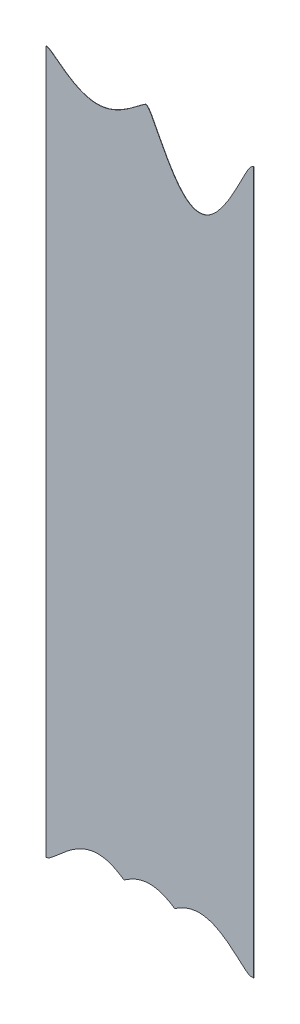
ISO-10303-21;
HEADER;
FILE_DESCRIPTION(('STEP AP214'),'2;1');
FILE_NAME('part.step','',(''),(''),'','','');
FILE_SCHEMA(('AUTOMOTIVE_DESIGN { 1 0 10303 214 1 1 1 1 }'));
ENDSEC;
DATA;
#1=APPLICATION_CONTEXT('core data for automotive mechanical design processes');
#2=APPLICATION_PROTOCOL_DEFINITION('international standard','automotive_design',2000,#1);
#3=PRODUCT_CONTEXT('',#1,'mechanical');
#4=PRODUCT('Part','Part','',(#3));
#5=PRODUCT_RELATED_PRODUCT_CATEGORY('part','',(#4));
#6=PRODUCT_DEFINITION_FORMATION('','',#4);
#7=PRODUCT_DEFINITION_CONTEXT('part definition',#1,'design');
#8=PRODUCT_DEFINITION('design','',#6,#7);
#9=PRODUCT_DEFINITION_SHAPE('','',#8);
#10=(LENGTH_UNIT() NAMED_UNIT(*) SI_UNIT(.MILLI.,.METRE.));
#11=(NAMED_UNIT(*) PLANE_ANGLE_UNIT() SI_UNIT($,.RADIAN.));
#12=(NAMED_UNIT(*) SI_UNIT($,.STERADIAN.) SOLID_ANGLE_UNIT());
#13=UNCERTAINTY_MEASURE_WITH_UNIT(LENGTH_MEASURE(1.E-05),#10,'distance_accuracy_value','');
#14=(GEOMETRIC_REPRESENTATION_CONTEXT(3) GLOBAL_UNCERTAINTY_ASSIGNED_CONTEXT((#13)) GLOBAL_UNIT_ASSIGNED_CONTEXT((#10,
#11,#12)) REPRESENTATION_CONTEXT('',''));
#15=CARTESIAN_POINT('',(0.,0.,0.));
#16=DIRECTION('',(0.,0.,1.));
#17=DIRECTION('',(1.,0.,0.));
#18=AXIS2_PLACEMENT_3D('',#15,#16,#17);
#19=CARTESIAN_POINT('',(-77.4248337125186,269.090560042543,192.698226624831));
#20=CARTESIAN_POINT('',(-77.209531905466,269.029841929501,192.699081003808));
#21=CARTESIAN_POINT('',(-77.0031450020932,269.023383046287,192.699900005905));
#22=B_SPLINE_CURVE_WITH_KNOTS('',2,(#19,#20,#21),.UNSPECIFIED.,.F.,.F.,(3,3),(0.,1.),.UNSPECIFIED.);
#23=DIRECTION('',(0.00396825396825352,0.,-0.999992126449225));
#24=VECTOR('',#23,1.);
#25=SURFACE_OF_LINEAR_EXTRUSION('',#22,#24);
#26=CARTESIAN_POINT('',(-77.4244368871217,269.090560042543,192.598227412186));
#27=CARTESIAN_POINT('',(-77.2091350800692,269.029841929501,192.599081791163));
#28=CARTESIAN_POINT('',(-77.0027481766964,269.023383046287,192.59990079326));
#29=B_SPLINE_CURVE_WITH_KNOTS('',2,(#26,#27,#28),.UNSPECIFIED.,.F.,.F.,(3,3),(0.,1.),.UNSPECIFIED.);
#30=CARTESIAN_POINT('',(-77.4244378112385,269.09055978193,192.598227408519));
#31=VERTEX_POINT('',#30);
#32=CARTESIAN_POINT('',(-77.0027481766964,269.023383046287,192.59990079326));
#33=VERTEX_POINT('',#32);
#34=EDGE_CURVE('E231',#31,#33,#29,.T.);
#35=ORIENTED_EDGE('',*,*,#34,.T.);
#36=DIRECTION('',(0.00396825396825352,0.,-0.999992126449225));
#37=VECTOR('',#36,1.);
#38=CARTESIAN_POINT('',(-77.0031450020932,269.023383046287,192.699900005905));
#39=LINE('',#38,#37);
#40=CARTESIAN_POINT('',(-77.0031450020932,269.023383046287,192.699900005905));
#41=VERTEX_POINT('',#40);
#42=EDGE_CURVE('E13',#41,#33,#39,.T.);
#43=ORIENTED_EDGE('',*,*,#42,.F.);
#44=CARTESIAN_POINT('',(-77.4248346366353,269.09055978193,192.698226621164));
#45=VERTEX_POINT('',#44);
#46=EDGE_CURVE('E266',#45,#41,#22,.T.);
#47=ORIENTED_EDGE('',*,*,#46,.F.);
#48=DIRECTION('',(0.00396825396825352,0.,-0.999992126449225));
#49=VECTOR('',#48,1.);
#50=CARTESIAN_POINT('',(-77.4248346366353,269.09055978193,192.698226621164));
#51=LINE('',#50,#49);
#52=EDGE_CURVE('E150',#45,#31,#51,.T.);
#53=ORIENTED_EDGE('',*,*,#52,.T.);
#54=EDGE_LOOP('',(#35,#43,#47,#53));
#55=FACE_BOUND('',#54,.T.);
#56=ADVANCED_FACE('F52',(#55),#25,.F.);
#57=CARTESIAN_POINT('',(-77.0031450020933,269.023383046284,192.699900005905));
#58=DIRECTION('',(-0.999992126449225,0.,-0.00396825396825352));
#59=DIRECTION('',(-0.00396825396825352,0.,0.999992126449225));
#60=AXIS2_PLACEMENT_3D('',#57,#58,#59);
#61=PLANE('',#60);
#62=DIRECTION('',(0.,1.,0.));
#63=VECTOR('',#62,1.);
#64=CARTESIAN_POINT('',(-77.0027481766965,269.023383046284,192.59990079326));
#65=LINE('',#64,#63);
#66=CARTESIAN_POINT('',(-77.0027481766964,536.798762383789,192.59990079326));
#67=VERTEX_POINT('',#66);
#68=EDGE_CURVE('E224',#33,#67,#65,.T.);
#69=ORIENTED_EDGE('',*,*,#68,.T.);
#70=DIRECTION('',(0.00396825396825352,0.,-0.999992126449225));
#71=VECTOR('',#70,1.);
#72=CARTESIAN_POINT('',(-77.0031450020932,536.798762383789,192.699900005905));
#73=LINE('',#72,#71);
#74=CARTESIAN_POINT('',(-77.0031450020932,536.798762383789,192.699900005905));
#75=VERTEX_POINT('',#74);
#76=EDGE_CURVE('E61',#75,#67,#73,.T.);
#77=ORIENTED_EDGE('',*,*,#76,.F.);
#78=DIRECTION('',(0.,1.,0.));
#79=VECTOR('',#78,1.);
#80=CARTESIAN_POINT('',(-77.0031450020933,269.023383046284,192.699900005905));
#81=LINE('',#80,#79);
#82=EDGE_CURVE('E115',#41,#75,#81,.T.);
#83=ORIENTED_EDGE('',*,*,#82,.F.);
#84=ORIENTED_EDGE('',*,*,#42,.T.);
#85=EDGE_LOOP('',(#69,#77,#83,#84));
#86=FACE_BOUND('',#85,.T.);
#87=ADVANCED_FACE('F293',(#86),#61,.F.);
#88=CARTESIAN_POINT('',(-77.0031450020932,536.798762383789,192.699900005905));
#89=CARTESIAN_POINT('',(-77.2661233072099,536.745601889857,192.698856432986));
#90=CARTESIAN_POINT('',(-77.7241891403564,536.504886026703,192.697038697114));
#91=CARTESIAN_POINT('',(-78.1225200868348,536.157177914668,192.695458006309));
#92=CARTESIAN_POINT('',(-78.4699339120561,535.752648616193,192.694079369163));
#93=CARTESIAN_POINT('',(-78.9033271113471,535.152786487229,192.692359541339));
#94=CARTESIAN_POINT('',(-79.2170173776124,534.63292863615,192.691114728894));
#95=CARTESIAN_POINT('',(-79.4561923109163,534.236560051497,192.690165614543));
#96=CARTESIAN_POINT('',(-79.7442402813425,533.717596674628,192.689022558042));
#97=CARTESIAN_POINT('',(-80.1428905244522,532.999366040864,192.687440600177));
#98=CARTESIAN_POINT('',(-80.7402656251471,531.851921506764,192.685070045398));
#99=CARTESIAN_POINT('',(-80.9454110452979,531.457875971932,192.684255969861));
#100=CARTESIAN_POINT('',(-81.2253546543758,530.914886505265,192.683145073777));
#101=CARTESIAN_POINT('',(-81.3511863839341,530.670818409025,192.682645737585));
#102=CARTESIAN_POINT('',(-81.7074309720887,529.978334175992,192.681232057454));
#103=CARTESIAN_POINT('',(-82.315394194015,528.796547955386,192.67881948599));
#104=CARTESIAN_POINT('',(-82.6721967104483,528.110242036952,192.677403591841));
#105=CARTESIAN_POINT('',(-83.1982487109191,527.098386501474,192.675316067466));
#106=CARTESIAN_POINT('',(-83.6490694057289,526.25242367581,192.673527082369));
#107=CARTESIAN_POINT('',(-84.7385225882531,524.208070115014,192.669203821415));
#108=CARTESIAN_POINT('',(-85.6843286261529,522.57928036476,192.665450593301));
#109=CARTESIAN_POINT('',(-86.8466121731742,520.577690765606,192.660838320688));
#110=CARTESIAN_POINT('',(-87.9162297471326,518.985432515547,192.656593773086));
#111=CARTESIAN_POINT('',(-89.2203980683777,517.044016424857,192.651418461222));
#112=CARTESIAN_POINT('',(-90.4502154436802,515.615389030759,192.646538195117));
#113=CARTESIAN_POINT('',(-91.1867844090042,514.759747678931,192.643615279384));
#114=CARTESIAN_POINT('',(-91.9064459981967,514.07578364902,192.640759456941));
#115=CARTESIAN_POINT('',(-92.735591316979,513.287766639173,192.637469171833));
#116=CARTESIAN_POINT('',(-93.5491456678006,512.721153308884,192.634240756133));
#117=CARTESIAN_POINT('',(-94.4904030548573,512.065599095202,192.630505578363));
#118=CARTESIAN_POINT('',(-95.4190129942719,511.700757369727,192.626820589272));
#119=CARTESIAN_POINT('',(-96.4704804987367,511.287646113508,192.622648066322));
#120=CARTESIAN_POINT('',(-98.5755541764351,511.198598646507,192.614294533575));
#121=CARTESIAN_POINT('',(-99.6392356365664,511.532507188992,192.610073542166));
#122=CARTESIAN_POINT('',(-100.604163314002,511.8354151614,192.606244433932));
#123=CARTESIAN_POINT('',(-101.580816687193,512.452586730697,192.602368794793));
#124=CARTESIAN_POINT('',(-102.423018591509,512.984795071158,192.59902669743));
#125=CARTESIAN_POINT('',(-103.280510134128,513.754779501639,192.595623926422));
#126=CARTESIAN_POINT('',(-104.023955021638,514.422355751494,192.592673725068));
#127=CARTESIAN_POINT('',(-104.784323840767,515.273514184056,192.589656364727));
#128=CARTESIAN_POINT('',(-106.050228275655,516.690570232997,192.584632894877));
#129=CARTESIAN_POINT('',(-107.391100121666,518.6506320657,192.579311932958));
#130=CARTESIAN_POINT('',(-108.476670182567,520.237498438819,192.575004081338));
#131=CARTESIAN_POINT('',(-109.653034416638,522.241955314544,192.570335932544));
#132=CARTESIAN_POINT('',(-110.616669290892,523.883933618067,192.566511954522));
#133=CARTESIAN_POINT('',(-111.718310313976,525.940076863676,192.56214032874));
#134=CARTESIAN_POINT('',(-112.180237750085,526.802235187318,192.560307268926));
#135=CARTESIAN_POINT('',(-112.710903316909,527.81988857811,192.558201436604));
#136=CARTESIAN_POINT('',(-113.142966561622,528.648453032841,192.556486886419));
#137=CARTESIAN_POINT('',(-113.93412269219,530.187170989474,192.553347353245));
#138=CARTESIAN_POINT('',(-114.467358280453,531.222717301503,192.551231322345));
#139=CARTESIAN_POINT('',(-114.666956735831,531.607438778925,192.550439258746));
#140=CARTESIAN_POINT('',(-115.269967026661,532.769727382564,192.548046341926));
#141=CARTESIAN_POINT('',(-115.665226981358,533.491221460733,192.546477837693));
#142=CARTESIAN_POINT('',(-115.952331014527,534.015291398223,192.545338527003));
#143=CARTESIAN_POINT('',(-116.189986174152,534.419245477904,192.544395443548));
#144=CARTESIAN_POINT('',(-116.498677479085,534.943943162511,192.543170468407));
#145=CARTESIAN_POINT('',(-116.919501763995,535.559437999124,192.54150051762));
#146=CARTESIAN_POINT('',(-117.250759512005,535.980822727626,192.540185992397));
#147=CARTESIAN_POINT('',(-117.625695647593,536.360192484867,192.538698138874));
#148=CARTESIAN_POINT('',(-118.058114314527,536.655506954392,192.536982178273));
#149=CARTESIAN_POINT('',(-118.304909703597,536.738353144728,192.53600282378));
#150=B_SPLINE_CURVE_WITH_KNOTS('',2,(#88,#89,#90,#91,#92,#93,#94,#95,#96,#97,#98,#99,#100,#101,
#102,#103,#104,#105,#106,#107,#108,#109,#110,#111,#112,#113,#114,#115,#116,#117,#118,#119,#120,
#121,#122,#123,#124,#125,#126,#127,#128,#129,#130,#131,#132,#133,#134,#135,#136,#137,#138,#139,
#140,#141,#142,#143,#144,#145,#146,#147,#148,#149),.UNSPECIFIED.,.F.,.F.,(3,1,1,1,1,2,2,2,2,2,2,
2,2,2,2,2,2,2,1,2,2,2,2,2,2,2,2,1,1,2,2,2,1,1,1,1,3),(0.,0.0078125,0.015625,0.0234375,0.03125,
0.046875,0.0625,0.09375,0.109375,0.125,0.15625,0.1875,0.25,0.3125,0.375,0.40625,0.4375,0.46875,
0.5,0.53125,0.5625,0.59375,0.625,0.6875,0.75,0.8125,0.84375,0.875,0.890625,0.90625,0.9375,
0.953125,0.96875,0.9765625,0.984375,0.9921875,1.),.UNSPECIFIED.);
#151=DIRECTION('',(0.00396825396825352,0.,-0.999992126449225));
#152=VECTOR('',#151,1.);
#153=SURFACE_OF_LINEAR_EXTRUSION('',#150,#152);
#154=CARTESIAN_POINT('',(-77.0027481766964,536.798762383789,192.59990079326));
#155=CARTESIAN_POINT('',(-77.2657264818131,536.745601889857,192.598857220341));
#156=CARTESIAN_POINT('',(-77.7237923149596,536.504886026703,192.597039484469));
#157=CARTESIAN_POINT('',(-78.122123261438,536.157177914668,192.595458793664));
#158=CARTESIAN_POINT('',(-78.4695370866593,535.752648616193,192.594080156519));
#159=CARTESIAN_POINT('',(-78.9029302859503,535.152786487229,192.592360328694));
#160=CARTESIAN_POINT('',(-79.2166205522156,534.63292863615,192.591115516249));
#161=CARTESIAN_POINT('',(-79.4557954855195,534.236560051497,192.590166401898));
#162=CARTESIAN_POINT('',(-79.7438434559457,533.717596674628,192.589023345397));
#163=CARTESIAN_POINT('',(-80.1424936990554,532.999366040864,192.587441387532));
#164=CARTESIAN_POINT('',(-80.7398687997503,531.851921506764,192.585070832753));
#165=CARTESIAN_POINT('',(-80.9450142199011,531.457875971932,192.584256757216));
#166=CARTESIAN_POINT('',(-81.224957828979,530.914886505265,192.583145861132));
#167=CARTESIAN_POINT('',(-81.3507895585373,530.670818409025,192.58264652494));
#168=CARTESIAN_POINT('',(-81.7070341466919,529.978334175992,192.581232844809));
#169=CARTESIAN_POINT('',(-82.3149973686181,528.796547955386,192.578820273345));
#170=CARTESIAN_POINT('',(-82.6717998850515,528.110242036952,192.577404379196));
#171=CARTESIAN_POINT('',(-83.1978518855223,527.098386501474,192.575316854821));
#172=CARTESIAN_POINT('',(-83.648672580332,526.25242367581,192.573527869724));
#173=CARTESIAN_POINT('',(-84.7381257628563,524.208070115014,192.56920460877));
#174=CARTESIAN_POINT('',(-85.6839318007561,522.57928036476,192.565451380656));
#175=CARTESIAN_POINT('',(-86.8462153477774,520.577690765606,192.560839108043));
#176=CARTESIAN_POINT('',(-87.9158329217358,518.985432515547,192.556594560441));
#177=CARTESIAN_POINT('',(-89.2200012429809,517.044016424857,192.551419248577));
#178=CARTESIAN_POINT('',(-90.4498186182834,515.615389030759,192.546538982472));
#179=CARTESIAN_POINT('',(-91.1863875836074,514.759747678931,192.543616066739));
#180=CARTESIAN_POINT('',(-91.9060491727999,514.07578364902,192.540760244296));
#181=CARTESIAN_POINT('',(-92.7351944915822,513.287766639173,192.537469959188));
#182=CARTESIAN_POINT('',(-93.5487488424038,512.721153308884,192.534241543488));
#183=CARTESIAN_POINT('',(-94.4900062294605,512.065599095202,192.530506365718));
#184=CARTESIAN_POINT('',(-95.418616168875,511.700757369727,192.526821376627));
#185=CARTESIAN_POINT('',(-96.4700836733399,511.287646113508,192.522648853677));
#186=CARTESIAN_POINT('',(-98.5751573510383,511.198598646507,192.51429532093));
#187=CARTESIAN_POINT('',(-99.6388388111695,511.532507188992,192.510074329521));
#188=CARTESIAN_POINT('',(-100.603766488605,511.8354151614,192.506245221287));
#189=CARTESIAN_POINT('',(-101.580419861796,512.452586730697,192.502369582148));
#190=CARTESIAN_POINT('',(-102.422621766113,512.984795071158,192.499027484785));
#191=CARTESIAN_POINT('',(-103.280113308731,513.754779501639,192.495624713777));
#192=CARTESIAN_POINT('',(-104.023558196241,514.422355751494,192.492674512423));
#193=CARTESIAN_POINT('',(-104.783927015371,515.273514184056,192.489657152082));
#194=CARTESIAN_POINT('',(-106.049831450258,516.690570232997,192.484633682232));
#195=CARTESIAN_POINT('',(-107.390703296269,518.6506320657,192.479312720314));
#196=CARTESIAN_POINT('',(-108.47627335717,520.237498438819,192.475004868693));
#197=CARTESIAN_POINT('',(-109.652637591242,522.241955314544,192.470336719899));
#198=CARTESIAN_POINT('',(-110.616272465495,523.883933618067,192.466512741877));
#199=CARTESIAN_POINT('',(-111.717913488579,525.940076863676,192.462141116095));
#200=CARTESIAN_POINT('',(-112.179840924688,526.802235187318,192.460308056281));
#201=CARTESIAN_POINT('',(-112.710506491512,527.81988857811,192.458202223959));
#202=CARTESIAN_POINT('',(-113.142569736225,528.648453032841,192.456487673774));
#203=CARTESIAN_POINT('',(-113.933725866793,530.187170989474,192.4533481406));
#204=CARTESIAN_POINT('',(-114.466961455056,531.222717301503,192.4512321097));
#205=CARTESIAN_POINT('',(-114.666559910434,531.607438778925,192.450440046101));
#206=CARTESIAN_POINT('',(-115.269570201264,532.769727382564,192.448047129281));
#207=CARTESIAN_POINT('',(-115.664830155962,533.491221460733,192.446478625048));
#208=CARTESIAN_POINT('',(-115.95193418913,534.015291398223,192.445339314358));
#209=CARTESIAN_POINT('',(-116.189589348755,534.419245477904,192.444396230903));
#210=CARTESIAN_POINT('',(-116.498280653688,534.943943162511,192.443171255762));
#211=CARTESIAN_POINT('',(-116.919104938598,535.559437999124,192.441501304975));
#212=CARTESIAN_POINT('',(-117.250362686608,535.980822727626,192.440186779752));
#213=CARTESIAN_POINT('',(-117.625298822197,536.360192484867,192.43869892623));
#214=CARTESIAN_POINT('',(-118.05771748913,536.655506954392,192.436982965628));
#215=CARTESIAN_POINT('',(-118.304512878201,536.738353144728,192.436003611135));
#216=B_SPLINE_CURVE_WITH_KNOTS('',2,(#154,#155,#156,#157,#158,#159,#160,#161,#162,#163,#164,
#165,#166,#167,#168,#169,#170,#171,#172,#173,#174,#175,#176,#177,#178,#179,#180,#181,#182,#183,
#184,#185,#186,#187,#188,#189,#190,#191,#192,#193,#194,#195,#196,#197,#198,#199,#200,#201,#202,
#203,#204,#205,#206,#207,#208,#209,#210,#211,#212,#213,#214,#215),.UNSPECIFIED.,.F.,.F.,(3,1,1,
1,1,2,2,2,2,2,2,2,2,2,2,2,2,2,1,2,2,2,2,2,2,2,2,1,1,2,2,2,1,1,1,1,3),(0.,0.0078125,0.015625,
0.0234375,0.03125,0.046875,0.0625,0.09375,0.109375,0.125,0.15625,0.1875,0.25,0.3125,0.375,
0.40625,0.4375,0.46875,0.5,0.53125,0.5625,0.59375,0.625,0.6875,0.75,0.8125,0.84375,0.875,
0.890625,0.90625,0.9375,0.953125,0.96875,0.9765625,0.984375,0.9921875,1.),.UNSPECIFIED.);
#217=CARTESIAN_POINT('',(-118.304512227476,536.738352926288,192.436003613717));
#218=VERTEX_POINT('',#217);
#219=EDGE_CURVE('E218',#67,#218,#216,.T.);
#220=ORIENTED_EDGE('',*,*,#219,.T.);
#221=DIRECTION('',(0.00396825396825352,0.,-0.999992126449225));
#222=VECTOR('',#221,1.);
#223=CARTESIAN_POINT('',(-118.304909052873,536.738352926288,192.536002826362));
#224=LINE('',#223,#222);
#225=CARTESIAN_POINT('',(-118.304909052873,536.738352926288,192.536002826362));
#226=VERTEX_POINT('',#225);
#227=EDGE_CURVE('E210',#226,#218,#224,.T.);
#228=ORIENTED_EDGE('',*,*,#227,.F.);
#229=EDGE_CURVE('E220',#75,#226,#150,.T.);
#230=ORIENTED_EDGE('',*,*,#229,.F.);
#231=ORIENTED_EDGE('',*,*,#76,.T.);
#232=EDGE_LOOP('',(#220,#228,#230,#231));
#233=FACE_BOUND('',#232,.T.);
#234=ADVANCED_FACE('F216',(#233),#153,.F.);
#235=CARTESIAN_POINT('',(-156.045391688402,536.841373071262,192.386237827197));
#236=CARTESIAN_POINT('',(-155.765318183027,536.765069028169,192.387349238747));
#237=CARTESIAN_POINT('',(-155.162845070259,536.45254159597,192.389740023892));
#238=CARTESIAN_POINT('',(-154.592723782437,536.087646645492,192.392002427768));
#239=CARTESIAN_POINT('',(-154.043168794489,535.702031737504,192.3941832187));
#240=CARTESIAN_POINT('',(-153.742388790449,535.48127210741,192.395376799542));
#241=CARTESIAN_POINT('',(-153.363029615969,535.202838734493,192.396882204945));
#242=CARTESIAN_POINT('',(-152.667189238269,534.676581587643,192.399643498026));
#243=CARTESIAN_POINT('',(-152.400469058819,534.474863772548,192.40070191977));
#244=CARTESIAN_POINT('',(-151.877971267864,534.079400683924,192.402775340028));
#245=CARTESIAN_POINT('',(-151.015669372125,533.431841613234,192.406197199889));
#246=CARTESIAN_POINT('',(-150.532856942733,533.078983689833,192.408113137313));
#247=CARTESIAN_POINT('',(-149.966096694572,532.664773466447,192.410362203625));
#248=CARTESIAN_POINT('',(-149.45059751703,532.30372294149,192.412407851389));
#249=CARTESIAN_POINT('',(-148.272729765341,531.478756018936,192.41708196657));
#250=CARTESIAN_POINT('',(-147.212872165682,530.827567207667,192.421287783811));
#251=CARTESIAN_POINT('',(-146.01156910529,530.089472663528,192.426054896981));
#252=CARTESIAN_POINT('',(-144.88435801285,529.525768207979,192.430527992091));
#253=CARTESIAN_POINT('',(-143.626709731363,528.896833712441,192.435518699169));
#254=CARTESIAN_POINT('',(-142.420935821994,528.464376655478,192.440303553944));
#255=CARTESIAN_POINT('',(-141.112159771375,527.994977347135,192.445497150592));
#256=CARTESIAN_POINT('',(-138.504260625672,527.487500402413,192.455846038209));
#257=CARTESIAN_POINT('',(-135.851481006829,527.441430089682,192.466373024343));
#258=CARTESIAN_POINT('',(-133.219579285513,527.868929585031,192.476817161025));
#259=CARTESIAN_POINT('',(-131.900910231581,528.304899972493,192.482050015932));
#260=CARTESIAN_POINT('',(-130.679733165645,528.708638148502,192.486895994825));
#261=CARTESIAN_POINT('',(-129.410836751034,529.314389088708,192.491931337704));
#262=CARTESIAN_POINT('',(-128.270639403012,529.858701144152,192.496455965979));
#263=CARTESIAN_POINT('',(-127.062193393948,530.580591386184,192.501251424407));
#264=CARTESIAN_POINT('',(-125.988191244157,531.222168805481,192.505513371257));
#265=CARTESIAN_POINT('',(-124.810001959099,532.034772517837,192.510188762375));
#266=CARTESIAN_POINT('',(-124.287629959298,532.395055395685,192.512261683457));
#267=CARTESIAN_POINT('',(-123.223529637176,533.165422377477,192.51648433703));
#268=CARTESIAN_POINT('',(-122.653741053082,533.592277361559,192.518745420643));
#269=CARTESIAN_POINT('',(-122.214644552296,533.921224860834,192.520487880794));
#270=CARTESIAN_POINT('',(-121.320530177807,534.603020667313,192.524035981645));
#271=CARTESIAN_POINT('',(-120.77134582513,535.022466343055,192.52621530179));
#272=CARTESIAN_POINT('',(-120.518362806926,535.213935971388,192.527219210561));
#273=CARTESIAN_POINT('',(-119.858655358954,535.713234069612,192.529837117871));
#274=CARTESIAN_POINT('',(-119.436746188699,536.012901321695,192.531511373793));
#275=CARTESIAN_POINT('',(-119.130950273405,536.230097410558,192.532724859201));
#276=CARTESIAN_POINT('',(-118.562920844534,536.600017899544,192.534978961984));
#277=CARTESIAN_POINT('',(-118.304909703597,536.738353144728,192.53600282378));
#278=B_SPLINE_CURVE_WITH_KNOTS('',2,(#235,#236,#237,#238,#239,#240,#241,#242,#243,#244,#245,
#246,#247,#248,#249,#250,#251,#252,#253,#254,#255,#256,#257,#258,#259,#260,#261,#262,#263,#264,
#265,#266,#267,#268,#269,#270,#271,#272,#273,#274,#275,#276,#277),.UNSPECIFIED.,.F.,.F.,(3,1,1,
1,2,2,1,1,2,2,2,2,2,1,1,1,2,2,2,2,1,2,1,1,2,2,1,3),(0.,0.015625,0.03125,0.046875,0.0625,0.09375,
0.109375,0.125,0.15625,0.1875,0.25,0.3125,0.375,0.4375,0.5,0.5625,0.625,0.6875,0.75,0.8125,
0.84375,0.875,0.90625,0.921875,0.9375,0.96875,0.984375,1.),.UNSPECIFIED.);
#279=DIRECTION('',(0.00396825396825352,0.,-0.999992126449225));
#280=VECTOR('',#279,1.);
#281=SURFACE_OF_LINEAR_EXTRUSION('',#278,#280);
#282=CARTESIAN_POINT('',(-156.044994863005,536.841373071262,192.286238614552));
#283=CARTESIAN_POINT('',(-155.764921357631,536.765069028169,192.287350026102));
#284=CARTESIAN_POINT('',(-155.162448244862,536.45254159597,192.289740811247));
#285=CARTESIAN_POINT('',(-154.59232695704,536.087646645492,192.292003215123));
#286=CARTESIAN_POINT('',(-154.042771969092,535.702031737504,192.294184006055));
#287=CARTESIAN_POINT('',(-153.741991965052,535.48127210741,192.295377586897));
#288=CARTESIAN_POINT('',(-153.362632790572,535.202838734493,192.2968829923));
#289=CARTESIAN_POINT('',(-152.666792412872,534.676581587643,192.299644285381));
#290=CARTESIAN_POINT('',(-152.400072233422,534.474863772548,192.300702707125));
#291=CARTESIAN_POINT('',(-151.877574442467,534.079400683924,192.302776127383));
#292=CARTESIAN_POINT('',(-151.015272546728,533.431841613234,192.306197987244));
#293=CARTESIAN_POINT('',(-150.532460117336,533.078983689833,192.308113924668));
#294=CARTESIAN_POINT('',(-149.965699869175,532.664773466447,192.31036299098));
#295=CARTESIAN_POINT('',(-149.450200691633,532.30372294149,192.312408638744));
#296=CARTESIAN_POINT('',(-148.272332939944,531.478756018936,192.317082753925));
#297=CARTESIAN_POINT('',(-147.212475340285,530.827567207667,192.321288571166));
#298=CARTESIAN_POINT('',(-146.011172279893,530.089472663528,192.326055684336));
#299=CARTESIAN_POINT('',(-144.883961187453,529.525768207979,192.330528779446));
#300=CARTESIAN_POINT('',(-143.626312905966,528.896833712441,192.335519486524));
#301=CARTESIAN_POINT('',(-142.420538996597,528.464376655478,192.340304341299));
#302=CARTESIAN_POINT('',(-141.111762945978,527.994977347135,192.345497937947));
#303=CARTESIAN_POINT('',(-138.503863800275,527.487500402413,192.355846825564));
#304=CARTESIAN_POINT('',(-135.851084181432,527.441430089682,192.366373811698));
#305=CARTESIAN_POINT('',(-133.219182460116,527.868929585031,192.37681794838));
#306=CARTESIAN_POINT('',(-131.900513406184,528.304899972493,192.382050803287));
#307=CARTESIAN_POINT('',(-130.679336340248,528.708638148502,192.38689678218));
#308=CARTESIAN_POINT('',(-129.410439925637,529.314389088708,192.391932125059));
#309=CARTESIAN_POINT('',(-128.270242577615,529.858701144152,192.396456753334));
#310=CARTESIAN_POINT('',(-127.061796568551,530.580591386184,192.401252211763));
#311=CARTESIAN_POINT('',(-125.98779441876,531.222168805481,192.405514158612));
#312=CARTESIAN_POINT('',(-124.809605133703,532.034772517837,192.41018954973));
#313=CARTESIAN_POINT('',(-124.287233133901,532.395055395685,192.412262470812));
#314=CARTESIAN_POINT('',(-123.223132811779,533.165422377477,192.416485124385));
#315=CARTESIAN_POINT('',(-122.653344227685,533.592277361559,192.418746207998));
#316=CARTESIAN_POINT('',(-122.214247726899,533.921224860834,192.420488668149));
#317=CARTESIAN_POINT('',(-121.32013335241,534.603020667313,192.424036769));
#318=CARTESIAN_POINT('',(-120.770948999733,535.022466343055,192.426216089145));
#319=CARTESIAN_POINT('',(-120.517965981529,535.213935971388,192.427219997916));
#320=CARTESIAN_POINT('',(-119.858258533557,535.713234069612,192.429837905226));
#321=CARTESIAN_POINT('',(-119.436349363303,536.012901321695,192.431512161148));
#322=CARTESIAN_POINT('',(-119.130553448008,536.230097410558,192.432725646556));
#323=CARTESIAN_POINT('',(-118.562524019137,536.600017899544,192.434979749339));
#324=CARTESIAN_POINT('',(-118.3045128782,536.738353144728,192.436003611135));
#325=B_SPLINE_CURVE_WITH_KNOTS('',2,(#282,#283,#284,#285,#286,#287,#288,#289,#290,#291,#292,
#293,#294,#295,#296,#297,#298,#299,#300,#301,#302,#303,#304,#305,#306,#307,#308,#309,#310,#311,
#312,#313,#314,#315,#316,#317,#318,#319,#320,#321,#322,#323,#324),.UNSPECIFIED.,.F.,.F.,(3,1,1,
1,2,2,1,1,2,2,2,2,2,1,1,1,2,2,2,2,1,2,1,1,2,2,1,3),(0.,0.015625,0.03125,0.046875,0.0625,0.09375,
0.109375,0.125,0.15625,0.1875,0.25,0.3125,0.375,0.4375,0.5,0.5625,0.625,0.6875,0.75,0.8125,
0.84375,0.875,0.90625,0.921875,0.9375,0.96875,0.984375,1.),.UNSPECIFIED.);
#326=CARTESIAN_POINT('',(-156.044993414352,536.841372676586,192.286238620301));
#327=VERTEX_POINT('',#326);
#328=EDGE_CURVE('E227',#327,#218,#325,.T.);
#329=ORIENTED_EDGE('',*,*,#328,.F.);
#330=DIRECTION('',(0.00396825396825352,0.,-0.999992126449225));
#331=VECTOR('',#330,1.);
#332=CARTESIAN_POINT('',(-156.045390239749,536.841372676586,192.386237832946));
#333=LINE('',#332,#331);
#334=CARTESIAN_POINT('',(-156.045390239749,536.841372676586,192.386237832946));
#335=VERTEX_POINT('',#334);
#336=EDGE_CURVE('E205',#335,#327,#333,.T.);
#337=ORIENTED_EDGE('',*,*,#336,.F.);
#338=EDGE_CURVE('E190',#335,#226,#278,.T.);
#339=ORIENTED_EDGE('',*,*,#338,.T.);
#340=ORIENTED_EDGE('',*,*,#227,.T.);
#341=EDGE_LOOP('',(#329,#337,#339,#340));
#342=FACE_BOUND('',#341,.T.);
#343=ADVANCED_FACE('F182',(#342),#281,.T.);
#344=CARTESIAN_POINT('',(-156.045391688397,536.841373071261,192.386237827197));
#345=CARTESIAN_POINT('',(-156.223575255245,536.84054643345,192.385530743984));
#346=CARTESIAN_POINT('',(-156.384417031628,536.816407153966,192.384892477941));
#347=B_SPLINE_CURVE_WITH_KNOTS('',2,(#344,#345,#346),.UNSPECIFIED.,.F.,.F.,(3,3),(0.,1.),.UNSPECIFIED.);
#348=DIRECTION('',(0.00396825396825352,0.,-0.999992126449225));
#349=VECTOR('',#348,1.);
#350=SURFACE_OF_LINEAR_EXTRUSION('',#347,#349);
#351=CARTESIAN_POINT('',(-156.044994863001,536.841373071261,192.286238614553));
#352=CARTESIAN_POINT('',(-156.223178429848,536.84054643345,192.285531531339));
#353=CARTESIAN_POINT('',(-156.384020206231,536.816407153966,192.284893265296));
#354=B_SPLINE_CURVE_WITH_KNOTS('',2,(#351,#352,#353),.UNSPECIFIED.,.F.,.F.,(3,3),(0.,1.),.UNSPECIFIED.);
#355=CARTESIAN_POINT('',(-156.384020206231,536.816407153966,192.284893265296));
#356=VERTEX_POINT('',#355);
#357=EDGE_CURVE('E229',#327,#356,#354,.T.);
#358=ORIENTED_EDGE('',*,*,#357,.T.);
#359=DIRECTION('',(0.00396825396825352,0.,-0.999992126449225));
#360=VECTOR('',#359,1.);
#361=CARTESIAN_POINT('',(-156.384417031628,536.816407153966,192.384892477941));
#362=LINE('',#361,#360);
#363=CARTESIAN_POINT('',(-156.384417031628,536.816407153966,192.384892477941));
#364=VERTEX_POINT('',#363);
#365=EDGE_CURVE('E200',#364,#356,#362,.T.);
#366=ORIENTED_EDGE('',*,*,#365,.F.);
#367=EDGE_CURVE('E186',#335,#364,#347,.T.);
#368=ORIENTED_EDGE('',*,*,#367,.F.);
#369=ORIENTED_EDGE('',*,*,#336,.T.);
#370=EDGE_LOOP('',(#358,#366,#368,#369));
#371=FACE_BOUND('',#370,.T.);
#372=ADVANCED_FACE('F177',(#371),#350,.F.);
#373=CARTESIAN_POINT('',(-156.384417031628,269.023383046284,192.384892477941));
#374=DIRECTION('',(-0.999992126449225,0.,-0.00396825396825352));
#375=DIRECTION('',(-0.00396825396825352,0.,0.999992126449225));
#376=AXIS2_PLACEMENT_3D('',#373,#374,#375);
#377=PLANE('',#376);
#378=DIRECTION('',(0.,1.,0.));
#379=VECTOR('',#378,1.);
#380=CARTESIAN_POINT('',(-156.384020206231,269.023383046284,192.284893265296));
#381=LINE('',#380,#379);
#382=CARTESIAN_POINT('',(-156.384020206231,269.023383046284,192.284893265296));
#383=VERTEX_POINT('',#382);
#384=EDGE_CURVE('E203',#383,#356,#381,.T.);
#385=ORIENTED_EDGE('',*,*,#384,.F.);
#386=DIRECTION('',(0.00396825396825352,0.,-0.999992126449225));
#387=VECTOR('',#386,1.);
#388=CARTESIAN_POINT('',(-156.384417031628,269.023383046284,192.384892477941));
#389=LINE('',#388,#387);
#390=CARTESIAN_POINT('',(-156.384417031628,269.023383046284,192.384892477941));
#391=VERTEX_POINT('',#390);
#392=EDGE_CURVE('E145',#391,#383,#389,.T.);
#393=ORIENTED_EDGE('',*,*,#392,.F.);
#394=DIRECTION('',(0.,1.,0.));
#395=VECTOR('',#394,1.);
#396=CARTESIAN_POINT('',(-156.384417031628,269.023383046284,192.384892477941));
#397=LINE('',#396,#395);
#398=EDGE_CURVE('E138',#391,#364,#397,.T.);
#399=ORIENTED_EDGE('',*,*,#398,.T.);
#400=ORIENTED_EDGE('',*,*,#365,.T.);
#401=EDGE_LOOP('',(#385,#393,#399,#400));
#402=FACE_BOUND('',#401,.T.);
#403=ADVANCED_FACE('F174',(#402),#377,.T.);
#404=CARTESIAN_POINT('',(-156.384417031628,269.023383046284,192.384892477941));
#405=CARTESIAN_POINT('',(-156.130400584763,269.031332497231,192.385900487651));
#406=CARTESIAN_POINT('',(-155.631720711285,269.199229942738,192.387879391619));
#407=CARTESIAN_POINT('',(-155.162969614565,269.456682052673,192.389739529664));
#408=CARTESIAN_POINT('',(-154.720587782007,269.757282209135,192.391495026949));
#409=CARTESIAN_POINT('',(-154.13535920463,270.201876704061,192.393817380859));
#410=CARTESIAN_POINT('',(-153.661459781603,270.600341961366,192.395697948931));
#411=CARTESIAN_POINT('',(-153.329984405857,270.879053887293,192.397013337763));
#412=CARTESIAN_POINT('',(-152.859594889327,271.288957804515,192.398879977526));
#413=CARTESIAN_POINT('',(-152.630576716892,271.488527400983,192.399788786953));
#414=CARTESIAN_POINT('',(-151.565658776265,272.423710471797,192.40401468507));
#415=CARTESIAN_POINT('',(-151.272264826594,272.679327866259,192.405178955942));
#416=CARTESIAN_POINT('',(-150.371187212322,273.464385336689,192.408754688914));
#417=CARTESIAN_POINT('',(-149.659096607114,274.056490898607,192.411580467533));
#418=CARTESIAN_POINT('',(-148.792068078922,274.77742782732,192.41502108402));
#419=CARTESIAN_POINT('',(-148.009175404546,275.378154997483,192.418127825443));
#420=CARTESIAN_POINT('',(-147.131722174416,276.051440127282,192.421609810121));
#421=CARTESIAN_POINT('',(-146.308625387055,276.613720874679,192.424876092931));
#422=CARTESIAN_POINT('',(-145.391070312093,277.240528755901,192.428517213167));
#423=CARTESIAN_POINT('',(-143.5563170636,278.302153749017,192.435798037352));
#424=CARTESIAN_POINT('',(-141.623114605392,279.181609643846,192.44346953608));
#425=CARTESIAN_POINT('',(-139.599791893899,279.814231782025,192.451498657677));
#426=CARTESIAN_POINT('',(-137.509590293649,280.140948150294,192.459793173779));
#427=CARTESIAN_POINT('',(-135.392621029365,280.122052813568,192.468193911606));
#428=CARTESIAN_POINT('',(-133.306064795959,279.759776953696,192.476473961853));
#429=CARTESIAN_POINT('',(-131.290423028272,279.096716403234,192.484472603273));
#430=CARTESIAN_POINT('',(-129.36928565714,278.195202609465,192.492096224295));
#431=CARTESIAN_POINT('',(-127.544095926949,277.116907747343,192.499339097712));
#432=CARTESIAN_POINT('',(-126.628989557853,276.482414355155,192.502970500784));
#433=B_SPLINE_CURVE_WITH_KNOTS('',2,(#404,#405,#406,#407,#408,#409,#410,#411,#412,#413,#414,
#415,#416,#417,#418,#419,#420,#421,#422,#423,#424,#425,#426,#427,#428,#429,#430,#431,#432),
.UNSPECIFIED.,.F.,.F.,(3,1,1,1,1,2,2,1,2,2,2,2,1,1,1,1,1,1,1,1,1,3),(0.,0.015625,0.03125,
0.046875,0.0625,0.09375,0.125,0.15625,0.1875,0.25,0.3125,0.375,0.4375,0.5,0.5625,0.625,0.6875,
0.75,0.8125,0.875,0.9375,1.),.UNSPECIFIED.);
#434=DIRECTION('',(0.00396825396825352,0.,-0.999992126449225));
#435=VECTOR('',#434,1.);
#436=SURFACE_OF_LINEAR_EXTRUSION('',#433,#435);
#437=CARTESIAN_POINT('',(-156.384020206231,269.023383046284,192.284893265296));
#438=CARTESIAN_POINT('',(-156.130003759366,269.031332497231,192.285901275006));
#439=CARTESIAN_POINT('',(-155.631323885888,269.199229942738,192.287880178974));
#440=CARTESIAN_POINT('',(-155.162572789168,269.456682052673,192.289740317019));
#441=CARTESIAN_POINT('',(-154.72019095661,269.757282209135,192.291495814304));
#442=CARTESIAN_POINT('',(-154.134962379233,270.201876704061,192.293818168214));
#443=CARTESIAN_POINT('',(-153.661062956206,270.600341961366,192.295698736286));
#444=CARTESIAN_POINT('',(-153.32958758046,270.879053887293,192.297014125118));
#445=CARTESIAN_POINT('',(-152.85919806393,271.288957804515,192.298880764881));
#446=CARTESIAN_POINT('',(-152.630179891495,271.488527400983,192.299789574308));
#447=CARTESIAN_POINT('',(-151.565261950868,272.423710471797,192.304015472425));
#448=CARTESIAN_POINT('',(-151.271868001198,272.679327866259,192.305179743297));
#449=CARTESIAN_POINT('',(-150.370790386925,273.464385336689,192.308755476269));
#450=CARTESIAN_POINT('',(-149.658699781717,274.056490898607,192.311581254888));
#451=CARTESIAN_POINT('',(-148.791671253525,274.77742782732,192.315021871375));
#452=CARTESIAN_POINT('',(-148.008778579149,275.378154997483,192.318128612798));
#453=CARTESIAN_POINT('',(-147.131325349019,276.051440127282,192.321610597476));
#454=CARTESIAN_POINT('',(-146.308228561658,276.613720874679,192.324876880286));
#455=CARTESIAN_POINT('',(-145.390673486696,277.240528755901,192.328518000522));
#456=CARTESIAN_POINT('',(-143.555920238204,278.302153749017,192.335798824707));
#457=CARTESIAN_POINT('',(-141.622717779995,279.181609643846,192.343470323435));
#458=CARTESIAN_POINT('',(-139.599395068502,279.814231782025,192.351499445032));
#459=CARTESIAN_POINT('',(-137.509193468252,280.140948150294,192.359793961134));
#460=CARTESIAN_POINT('',(-135.392224203968,280.122052813568,192.368194698961));
#461=CARTESIAN_POINT('',(-133.305667970562,279.759776953696,192.376474749208));
#462=CARTESIAN_POINT('',(-131.290026202875,279.096716403234,192.384473390629));
#463=CARTESIAN_POINT('',(-129.368888831743,278.195202609465,192.39209701165));
#464=CARTESIAN_POINT('',(-127.543699101552,277.116907747343,192.399339885067));
#465=CARTESIAN_POINT('',(-126.628592732457,276.482414355155,192.402971288139));
#466=B_SPLINE_CURVE_WITH_KNOTS('',2,(#437,#438,#439,#440,#441,#442,#443,#444,#445,#446,#447,
#448,#449,#450,#451,#452,#453,#454,#455,#456,#457,#458,#459,#460,#461,#462,#463,#464,#465),
.UNSPECIFIED.,.F.,.F.,(3,1,1,1,1,2,2,1,2,2,2,2,1,1,1,1,1,1,1,1,1,3),(0.,0.015625,0.03125,
0.046875,0.0625,0.09375,0.125,0.15625,0.1875,0.25,0.3125,0.375,0.4375,0.5,0.5625,0.625,0.6875,
0.75,0.8125,0.875,0.9375,1.),.UNSPECIFIED.);
#467=CARTESIAN_POINT('',(-126.62859317292,276.482414660553,192.402971286392));
#468=VERTEX_POINT('',#467);
#469=EDGE_CURVE('E144',#383,#468,#466,.T.);
#470=ORIENTED_EDGE('',*,*,#469,.T.);
#471=DIRECTION('',(0.00396825396825352,0.,-0.999992126449225));
#472=VECTOR('',#471,1.);
#473=CARTESIAN_POINT('',(-126.628989998317,276.482414660553,192.502970499036));
#474=LINE('',#473,#472);
#475=CARTESIAN_POINT('',(-126.628989998317,276.482414660553,192.502970499036));
#476=VERTEX_POINT('',#475);
#477=EDGE_CURVE('E141',#476,#468,#474,.T.);
#478=ORIENTED_EDGE('',*,*,#477,.F.);
#479=EDGE_CURVE('E132',#391,#476,#433,.T.);
#480=ORIENTED_EDGE('',*,*,#479,.F.);
#481=ORIENTED_EDGE('',*,*,#392,.T.);
#482=EDGE_LOOP('',(#470,#478,#480,#481));
#483=FACE_BOUND('',#482,.T.);
#484=ADVANCED_FACE('F142',(#483),#436,.F.);
#485=CARTESIAN_POINT('',(-126.628989557853,276.482414355155,192.502970500784));
#486=CARTESIAN_POINT('',(-125.551184443788,277.229715702884,192.507247538881));
#487=CARTESIAN_POINT('',(-124.475933292209,277.844229941681,192.511514442126));
#488=CARTESIAN_POINT('',(-124.362329287785,277.908384550727,192.511965255216));
#489=CARTESIAN_POINT('',(-123.221540546996,278.543921080315,192.516492230307));
#490=CARTESIAN_POINT('',(-122.122679361486,278.999337700112,192.520852824901));
#491=CARTESIAN_POINT('',(-122.004784227885,279.047280378897,192.521320666416));
#492=CARTESIAN_POINT('',(-120.743507153194,279.548574121383,192.526325773581));
#493=CARTESIAN_POINT('',(-118.277108365908,280.098709783935,192.536113147417));
#494=CARTESIAN_POINT('',(-115.688834933328,280.158762026427,192.546384154606));
#495=CARTESIAN_POINT('',(-113.191914578526,279.709940163813,192.556292646727));
#496=CARTESIAN_POINT('',(-111.914402062401,279.251006088666,192.561362180754));
#497=CARTESIAN_POINT('',(-111.79184732321,279.2058188981,192.561848512914));
#498=CARTESIAN_POINT('',(-110.671855496913,278.783352197265,192.566292959916));
#499=CARTESIAN_POINT('',(-109.51868364585,278.177395794037,192.570869074721));
#500=CARTESIAN_POINT('',(-109.406616389533,278.117662173993,192.571313789557));
#501=CARTESIAN_POINT('',(-108.31744783861,277.529411150007,192.575635921011));
#502=CARTESIAN_POINT('',(-107.230459335498,276.803596840149,192.579949401415));
#503=B_SPLINE_CURVE_WITH_KNOTS('',2,(#485,#486,#487,#488,#489,#490,#491,#492,#493,#494,#495,
#496,#497,#498,#499,#500,#501,#502),.UNSPECIFIED.,.F.,.F.,(3,1,1,1,1,1,1,1,1,1,1,1,1,1,1,1,3),
(0.,0.11875,0.125,0.13125,0.2440625,0.25,0.25625,0.375,0.5,0.625,0.74375,0.75,0.75625,0.8690625,
0.875,0.88125,1.),.UNSPECIFIED.);
#504=DIRECTION('',(0.00396825396825352,0.,-0.999992126449225));
#505=VECTOR('',#504,1.);
#506=SURFACE_OF_LINEAR_EXTRUSION('',#503,#505);
#507=CARTESIAN_POINT('',(-126.628592732457,276.482414355155,192.402971288139));
#508=CARTESIAN_POINT('',(-125.550787618391,277.229715702884,192.407248326236));
#509=CARTESIAN_POINT('',(-124.475536466812,277.844229941681,192.411515229481));
#510=CARTESIAN_POINT('',(-124.361932462388,277.908384550727,192.411966042571));
#511=CARTESIAN_POINT('',(-123.221143721599,278.543921080315,192.416493017662));
#512=CARTESIAN_POINT('',(-122.122282536089,278.999337700112,192.420853612256));
#513=CARTESIAN_POINT('',(-122.004387402488,279.047280378897,192.421321453771));
#514=CARTESIAN_POINT('',(-120.743110327797,279.548574121383,192.426326560936));
#515=CARTESIAN_POINT('',(-118.276711540511,280.098709783935,192.436113934772));
#516=CARTESIAN_POINT('',(-115.688438107931,280.158762026427,192.446384941961));
#517=CARTESIAN_POINT('',(-113.191517753129,279.709940163813,192.456293434082));
#518=CARTESIAN_POINT('',(-111.914005237004,279.251006088666,192.461362968109));
#519=CARTESIAN_POINT('',(-111.791450497813,279.2058188981,192.461849300269));
#520=CARTESIAN_POINT('',(-110.671458671517,278.783352197265,192.466293747271));
#521=CARTESIAN_POINT('',(-109.518286820453,278.177395794037,192.470869862076));
#522=CARTESIAN_POINT('',(-109.406219564136,278.117662173993,192.471314576912));
#523=CARTESIAN_POINT('',(-108.317051013213,277.529411150007,192.475636708366));
#524=CARTESIAN_POINT('',(-107.230062510101,276.803596840149,192.47995018877));
#525=B_SPLINE_CURVE_WITH_KNOTS('',2,(#507,#508,#509,#510,#511,#512,#513,#514,#515,#516,#517,
#518,#519,#520,#521,#522,#523,#524),.UNSPECIFIED.,.F.,.F.,(3,1,1,1,1,1,1,1,1,1,1,1,1,1,1,1,3),
(0.,0.11875,0.125,0.13125,0.2440625,0.25,0.25625,0.375,0.5,0.625,0.74375,0.75,0.75625,0.8690625,
0.875,0.88125,1.),.UNSPECIFIED.);
#526=CARTESIAN_POINT('',(-107.230062960297,276.803597140759,192.479950186983));
#527=VERTEX_POINT('',#526);
#528=EDGE_CURVE('E101',#468,#527,#525,.T.);
#529=ORIENTED_EDGE('',*,*,#528,.T.);
#530=DIRECTION('',(0.00396825396825352,0.,-0.999992126449225));
#531=VECTOR('',#530,1.);
#532=CARTESIAN_POINT('',(-107.230459785694,276.803597140759,192.579949399628));
#533=LINE('',#532,#531);
#534=CARTESIAN_POINT('',(-107.230459785694,276.803597140759,192.579949399628));
#535=VERTEX_POINT('',#534);
#536=EDGE_CURVE('E146',#535,#527,#533,.T.);
#537=ORIENTED_EDGE('',*,*,#536,.F.);
#538=EDGE_CURVE('E136',#476,#535,#503,.T.);
#539=ORIENTED_EDGE('',*,*,#538,.F.);
#540=ORIENTED_EDGE('',*,*,#477,.T.);
#541=EDGE_LOOP('',(#529,#537,#539,#540));
#542=FACE_BOUND('',#541,.T.);
#543=ADVANCED_FACE('F148',(#542),#506,.F.);
#544=CARTESIAN_POINT('',(-107.230459335498,276.803596840149,192.579949401415));
#545=CARTESIAN_POINT('',(-106.30714066694,277.420123970178,192.583613393234));
#546=CARTESIAN_POINT('',(-104.460076971805,278.454770273725,192.590943068782));
#547=CARTESIAN_POINT('',(-102.518363661075,279.297020113151,192.598648341001));
#548=CARTESIAN_POINT('',(-100.484590213008,279.885911669417,192.606718934101));
#549=CARTESIAN_POINT('',(-98.3946200944337,280.159917214141,192.615012531617));
#550=CARTESIAN_POINT('',(-96.2883256438379,280.089929556062,192.623370908739));
#551=CARTESIAN_POINT('',(-94.2100449331023,279.680528547647,192.631618119352));
#552=CARTESIAN_POINT('',(-92.2093794284121,278.97932852741,192.63955733069));
#553=CARTESIAN_POINT('',(-90.3030602475255,278.049336782028,192.647122148906));
#554=CARTESIAN_POINT('',(-89.3542558599172,277.473499952466,192.650887275327));
#555=CARTESIAN_POINT('',(-88.4948484721393,276.951918863737,192.654297648956));
#556=CARTESIAN_POINT('',(-87.591759643263,276.314371656439,192.657881363001));
#557=CARTESIAN_POINT('',(-86.7716871395257,275.735430894665,192.661135644591));
#558=CARTESIAN_POINT('',(-85.8909201982201,275.043197350449,192.66463077902));
#559=CARTESIAN_POINT('',(-85.1235382082572,274.440078035035,192.667675969623));
#560=CARTESIAN_POINT('',(-83.8821459965458,273.392041852878,192.67260216798));
#561=CARTESIAN_POINT('',(-83.1131301490278,272.727544787325,192.675653842196));
#562=CARTESIAN_POINT('',(-82.6665455203835,272.336326314258,192.677426017375));
#563=CARTESIAN_POINT('',(-82.5141665985092,272.202838851144,192.678030700397));
#564=CARTESIAN_POINT('',(-81.9678674383789,271.723097184709,192.680198571276));
#565=CARTESIAN_POINT('',(-81.8728314247593,271.639753609409,192.680575701283));
#566=CARTESIAN_POINT('',(-81.3808870388025,271.208333956872,192.682527876916));
#567=CARTESIAN_POINT('',(-81.071925158079,270.942588231184,192.683753925778));
#568=CARTESIAN_POINT('',(-80.6021715690098,270.538541595627,192.685618041999));
#569=CARTESIAN_POINT('',(-80.2573144517862,270.259481311275,192.686986533398));
#570=CARTESIAN_POINT('',(-79.7714200127307,269.866292846963,192.688914701116));
#571=CARTESIAN_POINT('',(-79.165870299619,269.455098312175,192.691317695088));
#572=CARTESIAN_POINT('',(-78.6989635549176,269.199136119388,192.693170514218));
#573=CARTESIAN_POINT('',(-78.2037113670196,269.032119235464,192.695135816152));
#574=CARTESIAN_POINT('',(-77.693635473686,269.014754196118,192.697159942777));
#575=CARTESIAN_POINT('',(-77.424833712519,269.090560042544,192.698226624831));
#576=B_SPLINE_CURVE_WITH_KNOTS('',2,(#544,#545,#546,#547,#548,#549,#550,#551,#552,#553,#554,
#555,#556,#557,#558,#559,#560,#561,#562,#563,#564,#565,#566,#567,#568,#569,#570,#571,#572,#573,
#574,#575),.UNSPECIFIED.,.F.,.F.,(3,1,1,1,1,1,1,1,1,2,2,2,1,1,2,1,2,2,2,1,1,1,1,3),(0.,0.0625,
0.125,0.1875,0.25,0.3125,0.375,0.4375,0.5,0.5625,0.625,0.6875,0.75,0.78125,0.8125,0.828125,
0.84375,0.875,0.90625,0.9375,0.953125,0.96875,0.984375,1.),.UNSPECIFIED.);
#577=DIRECTION('',(0.00396825396825352,0.,-0.999992126449225));
#578=VECTOR('',#577,1.);
#579=SURFACE_OF_LINEAR_EXTRUSION('',#576,#578);
#580=CARTESIAN_POINT('',(-107.230062510101,276.803596840149,192.47995018877));
#581=CARTESIAN_POINT('',(-106.306743841543,277.420123970178,192.483614180589));
#582=CARTESIAN_POINT('',(-104.459680146408,278.454770273725,192.490943856137));
#583=CARTESIAN_POINT('',(-102.517966835678,279.297020113151,192.498649128356));
#584=CARTESIAN_POINT('',(-100.484193387611,279.885911669417,192.506719721456));
#585=CARTESIAN_POINT('',(-98.3942232690369,280.159917214141,192.515013318972));
#586=CARTESIAN_POINT('',(-96.2879288184411,280.089929556062,192.523371696094));
#587=CARTESIAN_POINT('',(-94.2096481077055,279.680528547647,192.531618906707));
#588=CARTESIAN_POINT('',(-92.2089826030152,278.97932852741,192.539558118045));
#589=CARTESIAN_POINT('',(-90.3026634221287,278.049336782028,192.547122936261));
#590=CARTESIAN_POINT('',(-89.3538590345204,277.473499952466,192.550888062682));
#591=CARTESIAN_POINT('',(-88.4944516467425,276.951918863737,192.554298436311));
#592=CARTESIAN_POINT('',(-87.5913628178662,276.314371656439,192.557882150356));
#593=CARTESIAN_POINT('',(-86.7712903141289,275.735430894665,192.561136431946));
#594=CARTESIAN_POINT('',(-85.8905233728233,275.043197350449,192.564631566375));
#595=CARTESIAN_POINT('',(-85.1231413828604,274.440078035035,192.567676756978));
#596=CARTESIAN_POINT('',(-83.881749171149,273.392041852878,192.572602955335));
#597=CARTESIAN_POINT('',(-83.112733323631,272.727544787325,192.575654629551));
#598=CARTESIAN_POINT('',(-82.6661486949867,272.336326314258,192.57742680473));
#599=CARTESIAN_POINT('',(-82.5137697731124,272.202838851144,192.578031487752));
#600=CARTESIAN_POINT('',(-81.967470612982,271.723097184709,192.580199358631));
#601=CARTESIAN_POINT('',(-81.8724345993624,271.639753609409,192.580576488638));
#602=CARTESIAN_POINT('',(-81.3804902134057,271.208333956872,192.582528664271));
#603=CARTESIAN_POINT('',(-81.0715283326822,270.942588231184,192.583754713133));
#604=CARTESIAN_POINT('',(-80.601774743613,270.538541595627,192.585618829354));
#605=CARTESIAN_POINT('',(-80.2569176263894,270.259481311275,192.586987320753));
#606=CARTESIAN_POINT('',(-79.7710231873339,269.866292846963,192.588915488471));
#607=CARTESIAN_POINT('',(-79.1654734742222,269.455098312175,192.591318482443));
#608=CARTESIAN_POINT('',(-78.6985667295208,269.199136119388,192.593171301574));
#609=CARTESIAN_POINT('',(-78.2033145416228,269.032119235464,192.595136603507));
#610=CARTESIAN_POINT('',(-77.6932386482891,269.014754196118,192.597160730132));
#611=CARTESIAN_POINT('',(-77.4244368871222,269.090560042544,192.598227412186));
#612=B_SPLINE_CURVE_WITH_KNOTS('',2,(#580,#581,#582,#583,#584,#585,#586,#587,#588,#589,#590,
#591,#592,#593,#594,#595,#596,#597,#598,#599,#600,#601,#602,#603,#604,#605,#606,#607,#608,#609,
#610,#611),.UNSPECIFIED.,.F.,.F.,(3,1,1,1,1,1,1,1,1,2,2,2,1,1,2,1,2,2,2,1,1,1,1,3),(0.,0.0625,
0.125,0.1875,0.25,0.3125,0.375,0.4375,0.5,0.5625,0.625,0.6875,0.75,0.78125,0.8125,0.828125,
0.84375,0.875,0.90625,0.9375,0.953125,0.96875,0.984375,1.),.UNSPECIFIED.);
#613=EDGE_CURVE('E107',#527,#31,#612,.T.);
#614=ORIENTED_EDGE('',*,*,#613,.T.);
#615=ORIENTED_EDGE('',*,*,#52,.F.);
#616=EDGE_CURVE('E69',#535,#45,#576,.T.);
#617=ORIENTED_EDGE('',*,*,#616,.F.);
#618=ORIENTED_EDGE('',*,*,#536,.T.);
#619=EDGE_LOOP('',(#614,#615,#617,#618));
#620=FACE_BOUND('',#619,.T.);
#621=ADVANCED_FACE('F170',(#620),#579,.F.);
#622=CARTESIAN_POINT('',(2633.3762086606,-2442.99243354963,203.455458315984));
#623=DIRECTION('',(-0.00396825396825353,0.,0.999992126449225));
#624=DIRECTION('',(0.999992126449225,0.,0.00396825396825353));
#625=AXIS2_PLACEMENT_3D('',#622,#623,#624);
#626=PLANE('',#625);
#627=ORIENTED_EDGE('',*,*,#46,.T.);
#628=ORIENTED_EDGE('',*,*,#82,.T.);
#629=ORIENTED_EDGE('',*,*,#229,.T.);
#630=ORIENTED_EDGE('',*,*,#338,.F.);
#631=ORIENTED_EDGE('',*,*,#367,.T.);
#632=ORIENTED_EDGE('',*,*,#398,.F.);
#633=ORIENTED_EDGE('',*,*,#479,.T.);
#634=ORIENTED_EDGE('',*,*,#538,.T.);
#635=ORIENTED_EDGE('',*,*,#616,.T.);
#636=EDGE_LOOP('',(#627,#628,#629,#630,#631,#632,#633,#634,#635));
#637=FACE_BOUND('',#636,.T.);
#638=ADVANCED_FACE('F134',(#637),#626,.T.);
#639=CARTESIAN_POINT('',(2633.37660548599,-2442.99243354963,203.355459103339));
#640=DIRECTION('',(-0.00396825396825353,0.,0.999992126449225));
#641=DIRECTION('',(0.999992126449225,0.,0.00396825396825353));
#642=AXIS2_PLACEMENT_3D('',#639,#640,#641);
#643=PLANE('',#642);
#644=ORIENTED_EDGE('',*,*,#34,.F.);
#645=ORIENTED_EDGE('',*,*,#613,.F.);
#646=ORIENTED_EDGE('',*,*,#528,.F.);
#647=ORIENTED_EDGE('',*,*,#469,.F.);
#648=ORIENTED_EDGE('',*,*,#384,.T.);
#649=ORIENTED_EDGE('',*,*,#357,.F.);
#650=ORIENTED_EDGE('',*,*,#328,.T.);
#651=ORIENTED_EDGE('',*,*,#219,.F.);
#652=ORIENTED_EDGE('',*,*,#68,.F.);
#653=EDGE_LOOP('',(#644,#645,#646,#647,#648,#649,#650,#651,#652));
#654=FACE_BOUND('',#653,.T.);
#655=ADVANCED_FACE('F223',(#654),#643,.F.);
#656=CLOSED_SHELL('',(#56,#87,#234,#343,#372,#403,#484,#543,#621,#638,#655));
#657=MANIFOLD_SOLID_BREP('B2',#656);
#658=ADVANCED_BREP_SHAPE_REPRESENTATION('',(#18,#657),#14);
#659=SHAPE_DEFINITION_REPRESENTATION(#9,#658);
ENDSEC;
END-ISO-10303-21;
